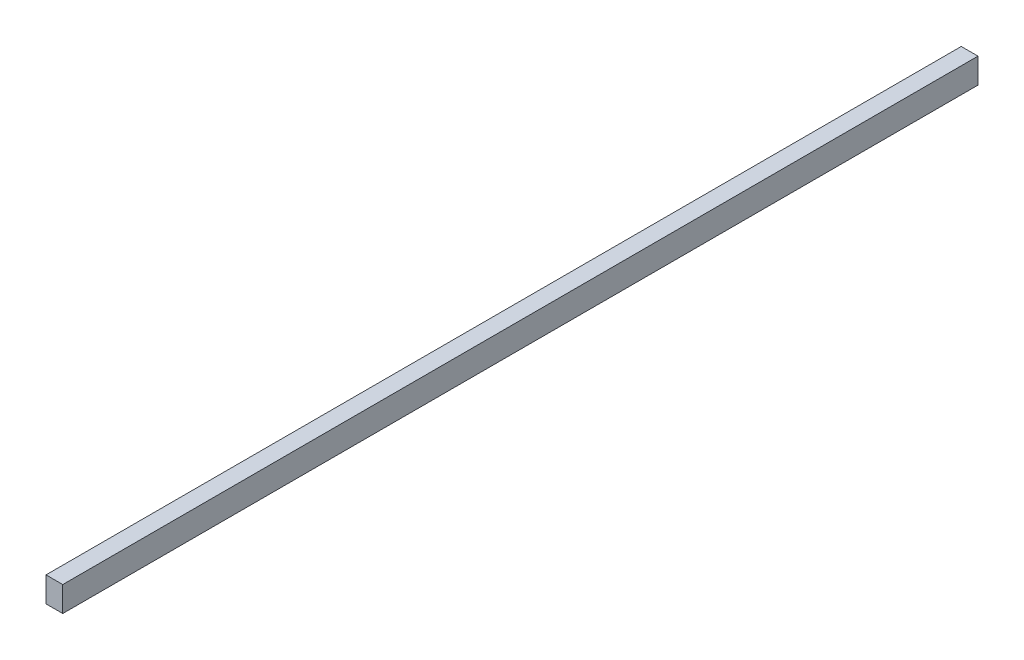
ISO-10303-21;
HEADER;
FILE_DESCRIPTION(('STEP AP214'),'2;1');
FILE_NAME('part.step','',(''),(''),'','','');
FILE_SCHEMA(('AUTOMOTIVE_DESIGN { 1 0 10303 214 1 1 1 1 }'));
ENDSEC;
DATA;
#1=APPLICATION_CONTEXT('core data for automotive mechanical design processes');
#2=APPLICATION_PROTOCOL_DEFINITION('international standard','automotive_design',2000,#1);
#3=PRODUCT_CONTEXT('',#1,'mechanical');
#4=PRODUCT('Part','Part','',(#3));
#5=PRODUCT_RELATED_PRODUCT_CATEGORY('part','',(#4));
#6=PRODUCT_DEFINITION_FORMATION('','',#4);
#7=PRODUCT_DEFINITION_CONTEXT('part definition',#1,'design');
#8=PRODUCT_DEFINITION('design','',#6,#7);
#9=PRODUCT_DEFINITION_SHAPE('','',#8);
#10=(LENGTH_UNIT() NAMED_UNIT(*) SI_UNIT(.MILLI.,.METRE.));
#11=(NAMED_UNIT(*) PLANE_ANGLE_UNIT() SI_UNIT($,.RADIAN.));
#12=(NAMED_UNIT(*) SI_UNIT($,.STERADIAN.) SOLID_ANGLE_UNIT());
#13=UNCERTAINTY_MEASURE_WITH_UNIT(LENGTH_MEASURE(1.E-05),#10,'distance_accuracy_value','');
#14=(GEOMETRIC_REPRESENTATION_CONTEXT(3) GLOBAL_UNCERTAINTY_ASSIGNED_CONTEXT((#13)) GLOBAL_UNIT_ASSIGNED_CONTEXT((#10,
#11,#12)) REPRESENTATION_CONTEXT('',''));
#15=CARTESIAN_POINT('',(0.,0.,0.));
#16=DIRECTION('',(0.,0.,1.));
#17=DIRECTION('',(1.,0.,0.));
#18=AXIS2_PLACEMENT_3D('',#15,#16,#17);
#19=CARTESIAN_POINT('',(0.,-21.5000000000003,0.));
#20=DIRECTION('',(0.,-1.,0.));
#21=DIRECTION('',(1.,0.,0.));
#22=AXIS2_PLACEMENT_3D('',#19,#20,#21);
#23=PLANE('',#22);
#24=DIRECTION('',(0.,0.,1.));
#25=VECTOR('',#24,1.);
#26=CARTESIAN_POINT('',(-261.,-21.5000000000003,1093.00000000004));
#27=LINE('',#26,#25);
#28=CARTESIAN_POINT('',(-261.,-21.5000000000002,0.));
#29=VERTEX_POINT('',#28);
#30=CARTESIAN_POINT('',(-261.,-21.5000000000003,1093.00000000004));
#31=VERTEX_POINT('',#30);
#32=EDGE_CURVE('E83',#29,#31,#27,.T.);
#33=ORIENTED_EDGE('',*,*,#32,.F.);
#34=DIRECTION('',(-1.,0.,0.));
#35=VECTOR('',#34,1.);
#36=CARTESIAN_POINT('',(-261.,-21.5000000000002,0.));
#37=LINE('',#36,#35);
#38=CARTESIAN_POINT('',(-241.,-21.5000000000002,0.));
#39=VERTEX_POINT('',#38);
#40=EDGE_CURVE('E94',#39,#29,#37,.T.);
#41=ORIENTED_EDGE('',*,*,#40,.F.);
#42=DIRECTION('',(0.,0.,-1.));
#43=VECTOR('',#42,1.);
#44=CARTESIAN_POINT('',(-241.,-21.5000000000003,1093.00000000004));
#45=LINE('',#44,#43);
#46=CARTESIAN_POINT('',(-241.,-21.5000000000003,1093.00000000004));
#47=VERTEX_POINT('',#46);
#48=EDGE_CURVE('E85',#47,#39,#45,.T.);
#49=ORIENTED_EDGE('',*,*,#48,.F.);
#50=DIRECTION('',(1.,0.,0.));
#51=VECTOR('',#50,1.);
#52=CARTESIAN_POINT('',(-261.,-21.5000000000003,1093.00000000004));
#53=LINE('',#52,#51);
#54=EDGE_CURVE('E75',#31,#47,#53,.T.);
#55=ORIENTED_EDGE('',*,*,#54,.F.);
#56=EDGE_LOOP('',(#33,#41,#49,#55));
#57=FACE_BOUND('',#56,.T.);
#58=ADVANCED_FACE('F33',(#57),#23,.T.);
#59=CARTESIAN_POINT('',(-261.,1101.6829673024,1.2469261440602E-13));
#60=DIRECTION('',(0.,0.,1.));
#61=DIRECTION('',(1.,0.,0.));
#62=AXIS2_PLACEMENT_3D('',#59,#60,#61);
#63=PLANE('',#62);
#64=DIRECTION('',(0.,-1.,0.));
#65=VECTOR('',#64,1.);
#66=CARTESIAN_POINT('',(-261.,1101.6829673024,1.2469261440602E-13));
#67=LINE('',#66,#65);
#68=CARTESIAN_POINT('',(-261.,8.49999999999995,0.));
#69=VERTEX_POINT('',#68);
#70=EDGE_CURVE('E88',#69,#29,#67,.T.);
#71=ORIENTED_EDGE('',*,*,#70,.F.);
#72=DIRECTION('',(1.,0.,0.));
#73=VECTOR('',#72,1.);
#74=CARTESIAN_POINT('',(-261.,8.49999999999995,0.));
#75=LINE('',#74,#73);
#76=CARTESIAN_POINT('',(-241.,8.49999999999995,0.));
#77=VERTEX_POINT('',#76);
#78=EDGE_CURVE('E37',#69,#77,#75,.T.);
#79=ORIENTED_EDGE('',*,*,#78,.T.);
#80=DIRECTION('',(0.,-1.,0.));
#81=VECTOR('',#80,1.);
#82=CARTESIAN_POINT('',(-240.999999999999,1101.6829673024,1.10814826598206E-13));
#83=LINE('',#82,#81);
#84=EDGE_CURVE('E97',#77,#39,#83,.T.);
#85=ORIENTED_EDGE('',*,*,#84,.T.);
#86=ORIENTED_EDGE('',*,*,#40,.T.);
#87=EDGE_LOOP('',(#71,#79,#85,#86));
#88=FACE_BOUND('',#87,.T.);
#89=ADVANCED_FACE('F106',(#88),#63,.F.);
#90=CARTESIAN_POINT('',(-240.999999999999,1101.6829673024,1093.00000000004));
#91=DIRECTION('',(-1.,0.,0.));
#92=DIRECTION('',(0.,-1.,0.));
#93=AXIS2_PLACEMENT_3D('',#90,#91,#92);
#94=PLANE('',#93);
#95=ORIENTED_EDGE('',*,*,#84,.F.);
#96=DIRECTION('',(0.,0.,1.));
#97=VECTOR('',#96,1.);
#98=CARTESIAN_POINT('',(-241.,8.49999999999995,1093.00000000004));
#99=LINE('',#98,#97);
#100=CARTESIAN_POINT('',(-241.,8.49999999999995,1093.00000000004));
#101=VERTEX_POINT('',#100);
#102=EDGE_CURVE('E103',#77,#101,#99,.T.);
#103=ORIENTED_EDGE('',*,*,#102,.T.);
#104=DIRECTION('',(0.,-1.,0.));
#105=VECTOR('',#104,1.);
#106=CARTESIAN_POINT('',(-240.999999999999,1101.6829673024,1093.00000000004));
#107=LINE('',#106,#105);
#108=EDGE_CURVE('E79',#101,#47,#107,.T.);
#109=ORIENTED_EDGE('',*,*,#108,.T.);
#110=ORIENTED_EDGE('',*,*,#48,.T.);
#111=EDGE_LOOP('',(#95,#103,#109,#110));
#112=FACE_BOUND('',#111,.T.);
#113=ADVANCED_FACE('F102',(#112),#94,.F.);
#114=CARTESIAN_POINT('',(-260.999999999999,1101.6829673024,1093.00000000004));
#115=DIRECTION('',(0.,0.,-1.));
#116=DIRECTION('',(0.,1.,0.));
#117=AXIS2_PLACEMENT_3D('',#114,#115,#116);
#118=PLANE('',#117);
#119=ORIENTED_EDGE('',*,*,#108,.F.);
#120=DIRECTION('',(-1.,0.,0.));
#121=VECTOR('',#120,1.);
#122=CARTESIAN_POINT('',(-260.999999999999,8.49999999999995,1093.00000000004));
#123=LINE('',#122,#121);
#124=CARTESIAN_POINT('',(-261.,8.49999999999995,1093.00000000004));
#125=VERTEX_POINT('',#124);
#126=EDGE_CURVE('E42',#101,#125,#123,.T.);
#127=ORIENTED_EDGE('',*,*,#126,.T.);
#128=DIRECTION('',(0.,-1.,0.));
#129=VECTOR('',#128,1.);
#130=CARTESIAN_POINT('',(-260.999999999999,1101.6829673024,1093.00000000004));
#131=LINE('',#130,#129);
#132=EDGE_CURVE('E72',#125,#31,#131,.T.);
#133=ORIENTED_EDGE('',*,*,#132,.T.);
#134=ORIENTED_EDGE('',*,*,#54,.T.);
#135=EDGE_LOOP('',(#119,#127,#133,#134));
#136=FACE_BOUND('',#135,.T.);
#137=ADVANCED_FACE('F74',(#136),#118,.F.);
#138=CARTESIAN_POINT('',(-260.999999999999,1101.6829673024,1093.00000000004));
#139=DIRECTION('',(1.,0.,0.));
#140=DIRECTION('',(0.,1.,0.));
#141=AXIS2_PLACEMENT_3D('',#138,#139,#140);
#142=PLANE('',#141);
#143=ORIENTED_EDGE('',*,*,#132,.F.);
#144=DIRECTION('',(0.,0.,-1.));
#145=VECTOR('',#144,1.);
#146=CARTESIAN_POINT('',(-261.,8.49999999999995,1093.00000000004));
#147=LINE('',#146,#145);
#148=EDGE_CURVE('E11',#125,#69,#147,.T.);
#149=ORIENTED_EDGE('',*,*,#148,.T.);
#150=ORIENTED_EDGE('',*,*,#70,.T.);
#151=ORIENTED_EDGE('',*,*,#32,.T.);
#152=EDGE_LOOP('',(#143,#149,#150,#151));
#153=FACE_BOUND('',#152,.T.);
#154=ADVANCED_FACE('F35',(#153),#142,.F.);
#155=CARTESIAN_POINT('',(2.22044604925031E-13,8.5,900.));
#156=DIRECTION('',(0.,-1.,0.));
#157=DIRECTION('',(-1.,0.,0.));
#158=AXIS2_PLACEMENT_3D('',#155,#156,#157);
#159=PLANE('',#158);
#160=ORIENTED_EDGE('',*,*,#126,.F.);
#161=ORIENTED_EDGE('',*,*,#102,.F.);
#162=ORIENTED_EDGE('',*,*,#78,.F.);
#163=ORIENTED_EDGE('',*,*,#148,.F.);
#164=EDGE_LOOP('',(#160,#161,#162,#163));
#165=FACE_BOUND('',#164,.T.);
#166=ADVANCED_FACE('F120',(#165),#159,.F.);
#167=CLOSED_SHELL('',(#58,#89,#113,#137,#154,#166));
#168=MANIFOLD_SOLID_BREP('B2',#167);
#169=ADVANCED_BREP_SHAPE_REPRESENTATION('',(#18,#168),#14);
#170=SHAPE_DEFINITION_REPRESENTATION(#9,#169);
ENDSEC;
END-ISO-10303-21;
